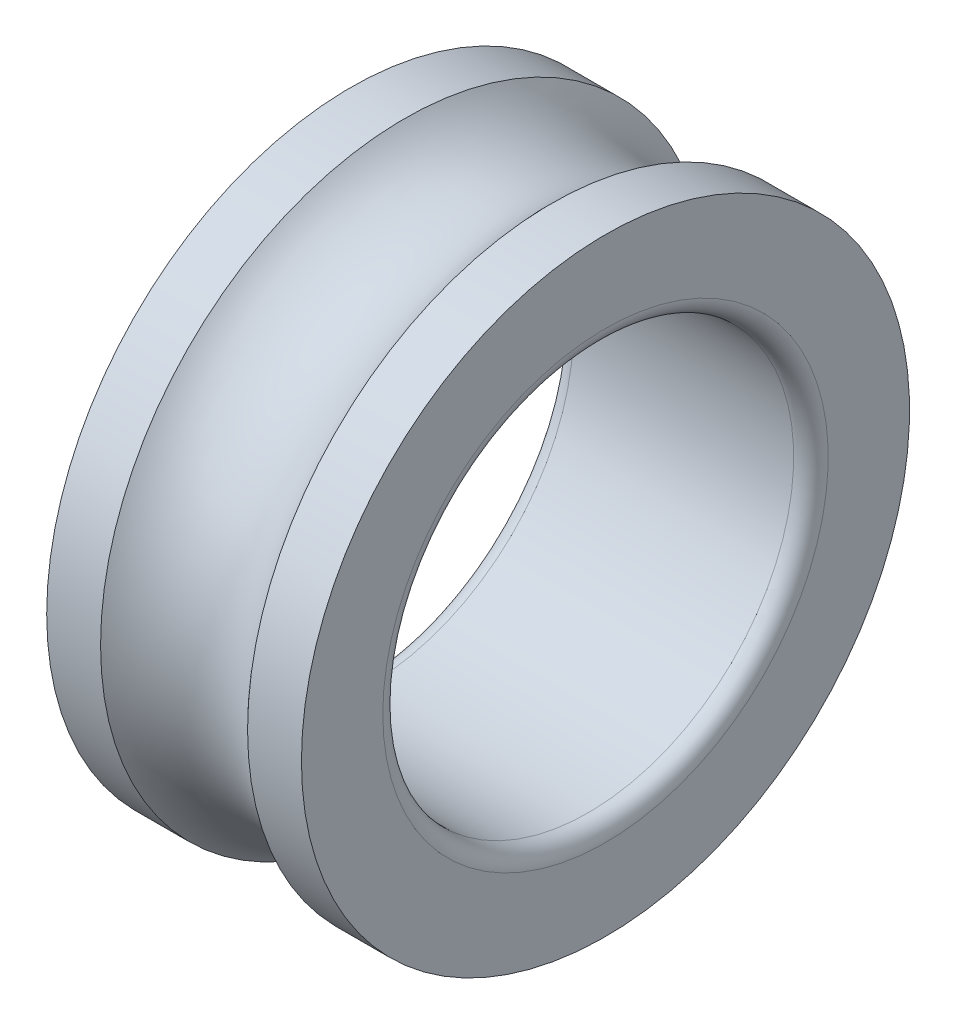
ISO-10303-21;
HEADER;
FILE_DESCRIPTION(('STEP AP214'),'2;1');
FILE_NAME('part.step','',(''),(''),'','','');
FILE_SCHEMA(('AUTOMOTIVE_DESIGN { 1 0 10303 214 1 1 1 1 }'));
ENDSEC;
DATA;
#1=APPLICATION_CONTEXT('core data for automotive mechanical design processes');
#2=APPLICATION_PROTOCOL_DEFINITION('international standard','automotive_design',2000,#1);
#3=PRODUCT_CONTEXT('',#1,'mechanical');
#4=PRODUCT('Part','Part','',(#3));
#5=PRODUCT_RELATED_PRODUCT_CATEGORY('part','',(#4));
#6=PRODUCT_DEFINITION_FORMATION('','',#4);
#7=PRODUCT_DEFINITION_CONTEXT('part definition',#1,'design');
#8=PRODUCT_DEFINITION('design','',#6,#7);
#9=PRODUCT_DEFINITION_SHAPE('','',#8);
#10=(LENGTH_UNIT() NAMED_UNIT(*) SI_UNIT(.MILLI.,.METRE.));
#11=(NAMED_UNIT(*) PLANE_ANGLE_UNIT() SI_UNIT($,.RADIAN.));
#12=(NAMED_UNIT(*) SI_UNIT($,.STERADIAN.) SOLID_ANGLE_UNIT());
#13=UNCERTAINTY_MEASURE_WITH_UNIT(LENGTH_MEASURE(1.E-05),#10,'distance_accuracy_value','');
#14=(GEOMETRIC_REPRESENTATION_CONTEXT(3) GLOBAL_UNCERTAINTY_ASSIGNED_CONTEXT((#13)) GLOBAL_UNIT_ASSIGNED_CONTEXT((#10,
#11,#12)) REPRESENTATION_CONTEXT('',''));
#15=CARTESIAN_POINT('',(0.,0.,0.));
#16=DIRECTION('',(0.,0.,1.));
#17=DIRECTION('',(1.,0.,0.));
#18=AXIS2_PLACEMENT_3D('',#15,#16,#17);
#19=CARTESIAN_POINT('',(22.9521554275418,93.2091861434946,101.931940707821));
#20=DIRECTION('',(-1.,0.,0.));
#21=DIRECTION('',(0.,0.,1.));
#22=AXIS2_PLACEMENT_3D('',#19,#20,#21);
#23=CYLINDRICAL_SURFACE('',#22,3.984456);
#24=CARTESIAN_POINT('',(26.5508682862489,93.2091861434946,101.931940707821));
#25=DIRECTION('',(-1.,0.,0.));
#26=DIRECTION('',(0.,0.,1.));
#27=AXIS2_PLACEMENT_3D('',#24,#25,#26);
#28=CIRCLE('',#27,3.984456);
#29=CARTESIAN_POINT('',(26.5508682862489,93.2091861434946,105.916396707821));
#30=VERTEX_POINT('',#29);
#31=EDGE_CURVE('E11',#30,#30,#28,.T.);
#32=ORIENTED_EDGE('',*,*,#31,.F.);
#33=EDGE_LOOP('',(#32));
#34=FACE_BOUND('',#33,.T.);
#35=CARTESIAN_POINT('',(27.2568415328049,93.2091861434946,101.931940707821));
#36=DIRECTION('',(-1.,0.,0.));
#37=DIRECTION('',(0.,0.,1.));
#38=AXIS2_PLACEMENT_3D('',#35,#36,#37);
#39=CIRCLE('',#38,3.984456);
#40=CARTESIAN_POINT('',(27.2568415328049,93.2091861434946,105.916396707821));
#41=VERTEX_POINT('',#40);
#42=EDGE_CURVE('E83',#41,#41,#39,.T.);
#43=ORIENTED_EDGE('',*,*,#42,.T.);
#44=EDGE_LOOP('',(#43));
#45=FACE_BOUND('',#44,.T.);
#46=ADVANCED_FACE('F44',(#34,#45),#23,.T.);
#47=CARTESIAN_POINT('',(25.5876775328049,93.2091861434946,101.931940707821));
#48=DIRECTION('',(-1.,0.,0.));
#49=DIRECTION('',(0.,0.,1.));
#50=AXIS2_PLACEMENT_3D('',#47,#48,#49);
#51=TOROIDAL_SURFACE('',#50,4.84596,1.292256);
#52=CARTESIAN_POINT('',(24.6244867793609,93.2091861434946,101.931940707821));
#53=DIRECTION('',(-1.,0.,0.));
#54=DIRECTION('',(0.,0.,1.));
#55=AXIS2_PLACEMENT_3D('',#52,#53,#54);
#56=CIRCLE('',#55,3.984456);
#57=CARTESIAN_POINT('',(24.6244867793609,93.2091861434946,105.916396707821));
#58=VERTEX_POINT('',#57);
#59=EDGE_CURVE('E51',#58,#58,#56,.T.);
#60=ORIENTED_EDGE('',*,*,#59,.F.);
#61=EDGE_LOOP('',(#60));
#62=FACE_BOUND('',#61,.T.);
#63=ORIENTED_EDGE('',*,*,#31,.T.);
#64=EDGE_LOOP('',(#63));
#65=FACE_BOUND('',#64,.T.);
#66=ADVANCED_FACE('F119',(#62,#65),#51,.F.);
#67=CARTESIAN_POINT('',(22.9521554275418,93.2091861434946,101.931940707821));
#68=DIRECTION('',(-1.,0.,0.));
#69=DIRECTION('',(0.,0.,1.));
#70=AXIS2_PLACEMENT_3D('',#67,#68,#69);
#71=CYLINDRICAL_SURFACE('',#70,3.984456);
#72=CARTESIAN_POINT('',(23.9185135328049,93.2091861434946,101.931940707821));
#73=DIRECTION('',(-1.,0.,0.));
#74=DIRECTION('',(0.,0.,1.));
#75=AXIS2_PLACEMENT_3D('',#72,#73,#74);
#76=CIRCLE('',#75,3.984456);
#77=CARTESIAN_POINT('',(23.9185135328049,93.2091861434946,105.916396707821));
#78=VERTEX_POINT('',#77);
#79=EDGE_CURVE('E55',#78,#78,#76,.T.);
#80=ORIENTED_EDGE('',*,*,#79,.F.);
#81=EDGE_LOOP('',(#80));
#82=FACE_BOUND('',#81,.T.);
#83=ORIENTED_EDGE('',*,*,#59,.T.);
#84=EDGE_LOOP('',(#83));
#85=FACE_BOUND('',#84,.T.);
#86=ADVANCED_FACE('F114',(#82,#85),#71,.T.);
#87=CARTESIAN_POINT('',(23.9185135328049,96.1275309434946,101.931940707821));
#88=DIRECTION('',(1.,0.,0.));
#89=DIRECTION('',(0.,0.,-1.));
#90=AXIS2_PLACEMENT_3D('',#87,#88,#89);
#91=PLANE('',#90);
#92=CARTESIAN_POINT('',(23.9185135328049,93.2091861434946,101.931940707821));
#93=DIRECTION('',(-1.,0.,0.));
#94=DIRECTION('',(0.,0.,1.));
#95=AXIS2_PLACEMENT_3D('',#92,#93,#94);
#96=CIRCLE('',#95,2.9183448);
#97=CARTESIAN_POINT('',(23.9185135328049,93.2091861434946,104.850285507821));
#98=VERTEX_POINT('',#97);
#99=EDGE_CURVE('E59',#98,#98,#96,.T.);
#100=ORIENTED_EDGE('',*,*,#99,.F.);
#101=EDGE_LOOP('',(#100));
#102=FACE_BOUND('',#101,.T.);
#103=ORIENTED_EDGE('',*,*,#79,.T.);
#104=EDGE_LOOP('',(#103));
#105=FACE_BOUND('',#104,.T.);
#106=ADVANCED_FACE('F108',(#102,#105),#91,.F.);
#107=CARTESIAN_POINT('',(24.1446583328049,93.2091861434946,101.931940707821));
#108=DIRECTION('',(-1.,0.,0.));
#109=DIRECTION('',(0.,0.,1.));
#110=AXIS2_PLACEMENT_3D('',#107,#108,#109);
#111=TOROIDAL_SURFACE('',#110,2.9183448,0.2261448);
#112=CARTESIAN_POINT('',(24.1446583328049,93.2091861434946,101.931940707821));
#113=DIRECTION('',(-1.,0.,0.));
#114=DIRECTION('',(0.,0.,1.));
#115=AXIS2_PLACEMENT_3D('',#112,#113,#114);
#116=CIRCLE('',#115,2.6922);
#117=CARTESIAN_POINT('',(24.1446583328049,93.2091861434946,104.624140707821));
#118=VERTEX_POINT('',#117);
#119=EDGE_CURVE('E73',#118,#118,#116,.T.);
#120=ORIENTED_EDGE('',*,*,#119,.F.);
#121=EDGE_LOOP('',(#120));
#122=FACE_BOUND('',#121,.T.);
#123=ORIENTED_EDGE('',*,*,#99,.T.);
#124=EDGE_LOOP('',(#123));
#125=FACE_BOUND('',#124,.T.);
#126=ADVANCED_FACE('F102',(#122,#125),#111,.T.);
#127=CARTESIAN_POINT('',(22.9521554275418,93.2091861434946,101.931940707821));
#128=DIRECTION('',(-1.,0.,0.));
#129=DIRECTION('',(0.,0.,1.));
#130=AXIS2_PLACEMENT_3D('',#127,#128,#129);
#131=CYLINDRICAL_SURFACE('',#130,2.6922);
#132=CARTESIAN_POINT('',(27.0306967328049,93.2091861434946,101.931940707821));
#133=DIRECTION('',(-1.,0.,0.));
#134=DIRECTION('',(0.,0.,1.));
#135=AXIS2_PLACEMENT_3D('',#132,#133,#134);
#136=CIRCLE('',#135,2.6922);
#137=CARTESIAN_POINT('',(27.0306967328049,93.2091861434946,104.624140707821));
#138=VERTEX_POINT('',#137);
#139=EDGE_CURVE('E70',#138,#138,#136,.T.);
#140=ORIENTED_EDGE('',*,*,#139,.F.);
#141=EDGE_LOOP('',(#140));
#142=FACE_BOUND('',#141,.T.);
#143=ORIENTED_EDGE('',*,*,#119,.T.);
#144=EDGE_LOOP('',(#143));
#145=FACE_BOUND('',#144,.T.);
#146=ADVANCED_FACE('F96',(#142,#145),#131,.F.);
#147=CARTESIAN_POINT('',(27.0306967328049,93.2091861434946,101.931940707821));
#148=DIRECTION('',(-1.,0.,0.));
#149=DIRECTION('',(0.,0.,1.));
#150=AXIS2_PLACEMENT_3D('',#147,#148,#149);
#151=TOROIDAL_SURFACE('',#150,2.9183448,0.2261448);
#152=CARTESIAN_POINT('',(27.2568415328049,93.2091861434946,101.931940707821));
#153=DIRECTION('',(-1.,0.,0.));
#154=DIRECTION('',(0.,0.,1.));
#155=AXIS2_PLACEMENT_3D('',#152,#153,#154);
#156=CIRCLE('',#155,2.9183448);
#157=CARTESIAN_POINT('',(27.2568415328049,93.2091861434946,104.850285507821));
#158=VERTEX_POINT('',#157);
#159=EDGE_CURVE('E74',#158,#158,#156,.T.);
#160=ORIENTED_EDGE('',*,*,#159,.F.);
#161=EDGE_LOOP('',(#160));
#162=FACE_BOUND('',#161,.T.);
#163=ORIENTED_EDGE('',*,*,#139,.T.);
#164=EDGE_LOOP('',(#163));
#165=FACE_BOUND('',#164,.T.);
#166=ADVANCED_FACE('F93',(#162,#165),#151,.T.);
#167=CARTESIAN_POINT('',(27.2568415328049,96.1275309434946,101.931940707821));
#168=DIRECTION('',(-1.,0.,0.));
#169=DIRECTION('',(0.,0.,1.));
#170=AXIS2_PLACEMENT_3D('',#167,#168,#169);
#171=PLANE('',#170);
#172=ORIENTED_EDGE('',*,*,#42,.F.);
#173=EDGE_LOOP('',(#172));
#174=FACE_BOUND('',#173,.T.);
#175=ORIENTED_EDGE('',*,*,#159,.T.);
#176=EDGE_LOOP('',(#175));
#177=FACE_BOUND('',#176,.T.);
#178=ADVANCED_FACE('F91',(#174,#177),#171,.F.);
#179=CLOSED_SHELL('',(#46,#66,#86,#106,#126,#146,#166,#178));
#180=MANIFOLD_SOLID_BREP('B2',#179);
#181=ADVANCED_BREP_SHAPE_REPRESENTATION('',(#18,#180),#14);
#182=SHAPE_DEFINITION_REPRESENTATION(#9,#181);
ENDSEC;
END-ISO-10303-21;
